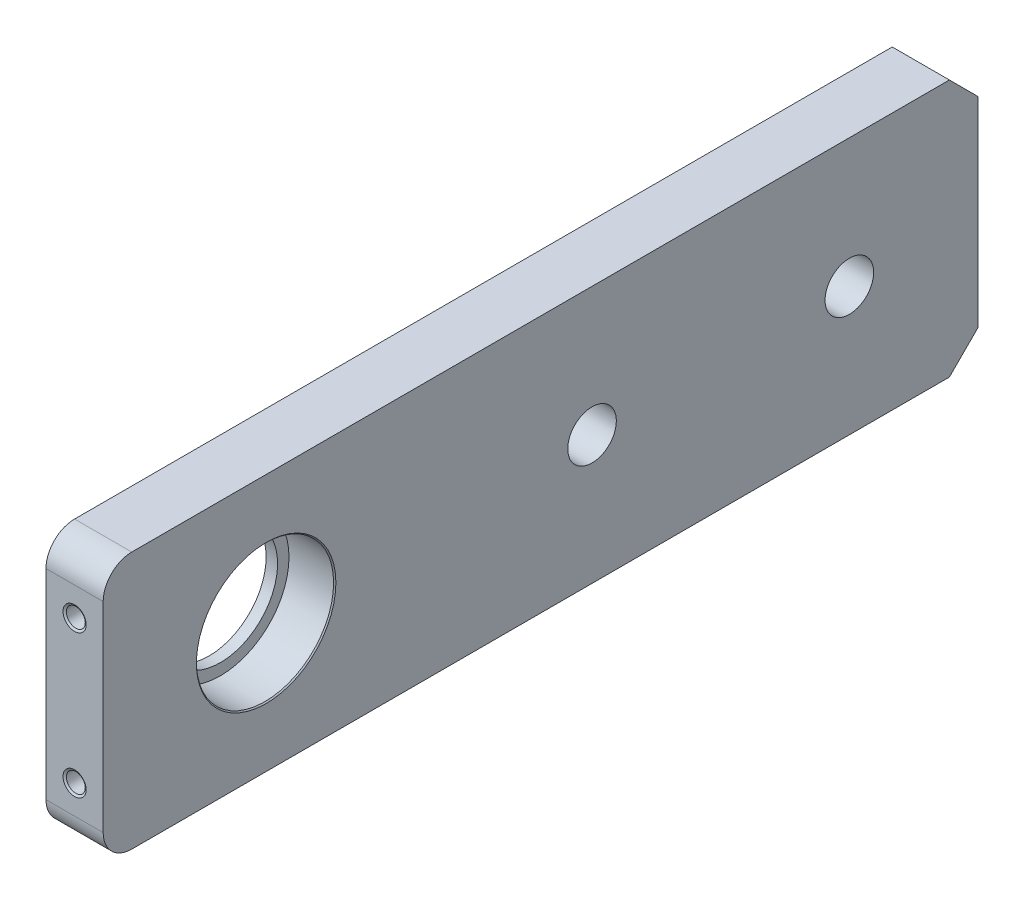
ISO-10303-21;
HEADER;
FILE_DESCRIPTION(('STEP AP214'),'2;1');
FILE_NAME('part.step','',(''),(''),'','','');
FILE_SCHEMA(('AUTOMOTIVE_DESIGN { 1 0 10303 214 1 1 1 1 }'));
ENDSEC;
DATA;
#1=APPLICATION_CONTEXT('core data for automotive mechanical design processes');
#2=APPLICATION_PROTOCOL_DEFINITION('international standard','automotive_design',2000,#1);
#3=PRODUCT_CONTEXT('',#1,'mechanical');
#4=PRODUCT('Part','Part','',(#3));
#5=PRODUCT_RELATED_PRODUCT_CATEGORY('part','',(#4));
#6=PRODUCT_DEFINITION_FORMATION('','',#4);
#7=PRODUCT_DEFINITION_CONTEXT('part definition',#1,'design');
#8=PRODUCT_DEFINITION('design','',#6,#7);
#9=PRODUCT_DEFINITION_SHAPE('','',#8);
#10=(LENGTH_UNIT() NAMED_UNIT(*) SI_UNIT(.MILLI.,.METRE.));
#11=(NAMED_UNIT(*) PLANE_ANGLE_UNIT() SI_UNIT($,.RADIAN.));
#12=(NAMED_UNIT(*) SI_UNIT($,.STERADIAN.) SOLID_ANGLE_UNIT());
#13=UNCERTAINTY_MEASURE_WITH_UNIT(LENGTH_MEASURE(1.E-05),#10,'distance_accuracy_value','');
#14=(GEOMETRIC_REPRESENTATION_CONTEXT(3) GLOBAL_UNCERTAINTY_ASSIGNED_CONTEXT((#13)) GLOBAL_UNIT_ASSIGNED_CONTEXT((#10,
#11,#12)) REPRESENTATION_CONTEXT('',''));
#15=CARTESIAN_POINT('',(0.,0.,0.));
#16=DIRECTION('',(0.,0.,1.));
#17=DIRECTION('',(1.,0.,0.));
#18=AXIS2_PLACEMENT_3D('',#15,#16,#17);
#19=CARTESIAN_POINT('',(5.,0.,0.));
#20=DIRECTION('',(1.,0.,0.));
#21=DIRECTION('',(0.,0.,-1.));
#22=AXIS2_PLACEMENT_3D('',#19,#20,#21);
#23=PLANE('',#22);
#24=CARTESIAN_POINT('',(5.,-22.5,-28.5));
#25=DIRECTION('',(1.,0.,0.));
#26=DIRECTION('',(0.,0.,-1.));
#27=AXIS2_PLACEMENT_3D('',#24,#25,#26);
#28=CIRCLE('',#27,12.2);
#29=CARTESIAN_POINT('',(5.,-22.5,-40.7));
#30=VERTEX_POINT('',#29);
#31=EDGE_CURVE('E45',#30,#30,#28,.F.);
#32=ORIENTED_EDGE('',*,*,#31,.T.);
#33=EDGE_LOOP('',(#32));
#34=FACE_BOUND('',#33,.T.);
#35=CARTESIAN_POINT('',(5.,-22.5,-85.5));
#36=DIRECTION('',(1.,0.,0.));
#37=DIRECTION('',(0.,0.,-1.));
#38=AXIS2_PLACEMENT_3D('',#35,#36,#37);
#39=CIRCLE('',#38,4.25);
#40=CARTESIAN_POINT('',(5.,-22.5,-89.75));
#41=VERTEX_POINT('',#40);
#42=EDGE_CURVE('E241',#41,#41,#39,.T.);
#43=ORIENTED_EDGE('',*,*,#42,.F.);
#44=EDGE_LOOP('',(#43));
#45=FACE_BOUND('',#44,.T.);
#46=DIRECTION('',(0.,0.,1.));
#47=VECTOR('',#46,1.);
#48=CARTESIAN_POINT('',(5.,0.,0.));
#49=LINE('',#48,#47);
#50=CARTESIAN_POINT('',(5.,0.,-148.));
#51=VERTEX_POINT('',#50);
#52=CARTESIAN_POINT('',(5.,0.,-5.));
#53=VERTEX_POINT('',#52);
#54=EDGE_CURVE('E146',#51,#53,#49,.T.);
#55=ORIENTED_EDGE('',*,*,#54,.T.);
#56=CARTESIAN_POINT('',(5.,-5.,-5.));
#57=DIRECTION('',(1.,0.,0.));
#58=DIRECTION('',(0.,0.,-1.));
#59=AXIS2_PLACEMENT_3D('',#56,#57,#58);
#60=CIRCLE('',#59,5.);
#61=CARTESIAN_POINT('',(5.,-5.,0.));
#62=VERTEX_POINT('',#61);
#63=EDGE_CURVE('E168',#53,#62,#60,.T.);
#64=ORIENTED_EDGE('',*,*,#63,.T.);
#65=DIRECTION('',(0.,-1.,0.));
#66=VECTOR('',#65,1.);
#67=CARTESIAN_POINT('',(5.,0.,0.));
#68=LINE('',#67,#66);
#69=CARTESIAN_POINT('',(5.,-40.,0.));
#70=VERTEX_POINT('',#69);
#71=EDGE_CURVE('E135',#62,#70,#68,.T.);
#72=ORIENTED_EDGE('',*,*,#71,.T.);
#73=CARTESIAN_POINT('',(5.,-40.,-5.00000000000001));
#74=DIRECTION('',(1.,0.,0.));
#75=DIRECTION('',(0.,0.,-1.));
#76=AXIS2_PLACEMENT_3D('',#73,#74,#75);
#77=CIRCLE('',#76,5.);
#78=CARTESIAN_POINT('',(5.,-45.,-5.00000000000001));
#79=VERTEX_POINT('',#78);
#80=EDGE_CURVE('E52',#70,#79,#77,.T.);
#81=ORIENTED_EDGE('',*,*,#80,.T.);
#82=DIRECTION('',(0.,0.,-1.));
#83=VECTOR('',#82,1.);
#84=CARTESIAN_POINT('',(5.,-45.,0.));
#85=LINE('',#84,#83);
#86=CARTESIAN_POINT('',(5.,-45.,-148.));
#87=VERTEX_POINT('',#86);
#88=EDGE_CURVE('E232',#79,#87,#85,.T.);
#89=ORIENTED_EDGE('',*,*,#88,.T.);
#90=DIRECTION('',(0.,-0.707106781186547,0.707106781186549));
#91=VECTOR('',#90,1.);
#92=CARTESIAN_POINT('',(5.,-96.5000000000001,-96.4999999999998));
#93=LINE('',#92,#91);
#94=CARTESIAN_POINT('',(5.,-40.,-153.));
#95=VERTEX_POINT('',#94);
#96=EDGE_CURVE('E152',#87,#95,#93,.F.);
#97=ORIENTED_EDGE('',*,*,#96,.T.);
#98=DIRECTION('',(0.,1.,0.));
#99=VECTOR('',#98,1.);
#100=CARTESIAN_POINT('',(5.,0.,-153.));
#101=LINE('',#100,#99);
#102=CARTESIAN_POINT('',(5.,-5.,-153.));
#103=VERTEX_POINT('',#102);
#104=EDGE_CURVE('E125',#95,#103,#101,.T.);
#105=ORIENTED_EDGE('',*,*,#104,.T.);
#106=DIRECTION('',(0.,-0.707106781186551,-0.707106781186544));
#107=VECTOR('',#106,1.);
#108=CARTESIAN_POINT('',(5.,74.,-74.0000000000008));
#109=LINE('',#108,#107);
#110=EDGE_CURVE('E150',#103,#51,#109,.F.);
#111=ORIENTED_EDGE('',*,*,#110,.T.);
#112=EDGE_LOOP('',(#55,#64,#72,#81,#89,#97,#105,#111));
#113=FACE_BOUND('',#112,.T.);
#114=CARTESIAN_POINT('',(5.,-22.5,-130.5));
#115=DIRECTION('',(1.,0.,0.));
#116=DIRECTION('',(0.,0.,-1.));
#117=AXIS2_PLACEMENT_3D('',#114,#115,#116);
#118=CIRCLE('',#117,4.25);
#119=CARTESIAN_POINT('',(5.,-22.5,-134.75));
#120=VERTEX_POINT('',#119);
#121=EDGE_CURVE('E249',#120,#120,#118,.T.);
#122=ORIENTED_EDGE('',*,*,#121,.F.);
#123=EDGE_LOOP('',(#122));
#124=FACE_BOUND('',#123,.T.);
#125=ADVANCED_FACE('F37',(#34,#45,#113,#124),#23,.T.);
#126=CARTESIAN_POINT('',(-5.,0.,0.));
#127=DIRECTION('',(1.,0.,0.));
#128=DIRECTION('',(0.,0.,-1.));
#129=AXIS2_PLACEMENT_3D('',#126,#127,#128);
#130=PLANE('',#129);
#131=DIRECTION('',(0.,-1.,0.));
#132=VECTOR('',#131,1.);
#133=CARTESIAN_POINT('',(-5.,0.,0.));
#134=LINE('',#133,#132);
#135=CARTESIAN_POINT('',(-5.,-5.,0.));
#136=VERTEX_POINT('',#135);
#137=CARTESIAN_POINT('',(-5.,-40.,0.));
#138=VERTEX_POINT('',#137);
#139=EDGE_CURVE('E137',#136,#138,#134,.T.);
#140=ORIENTED_EDGE('',*,*,#139,.F.);
#141=CARTESIAN_POINT('',(-5.,-5.,-5.));
#142=DIRECTION('',(1.,0.,0.));
#143=DIRECTION('',(0.,0.,-1.));
#144=AXIS2_PLACEMENT_3D('',#141,#142,#143);
#145=CIRCLE('',#144,5.);
#146=CARTESIAN_POINT('',(-5.,0.,-5.));
#147=VERTEX_POINT('',#146);
#148=EDGE_CURVE('E164',#136,#147,#145,.F.);
#149=ORIENTED_EDGE('',*,*,#148,.T.);
#150=DIRECTION('',(0.,0.,1.));
#151=VECTOR('',#150,1.);
#152=CARTESIAN_POINT('',(-5.,0.,0.));
#153=LINE('',#152,#151);
#154=CARTESIAN_POINT('',(-5.,0.,-148.));
#155=VERTEX_POINT('',#154);
#156=EDGE_CURVE('E132',#155,#147,#153,.T.);
#157=ORIENTED_EDGE('',*,*,#156,.F.);
#158=DIRECTION('',(0.,0.707106781186551,0.707106781186544));
#159=VECTOR('',#158,1.);
#160=CARTESIAN_POINT('',(-5.,0.,-148.));
#161=LINE('',#160,#159);
#162=CARTESIAN_POINT('',(-5.,-5.,-153.));
#163=VERTEX_POINT('',#162);
#164=EDGE_CURVE('E116',#155,#163,#161,.F.);
#165=ORIENTED_EDGE('',*,*,#164,.T.);
#166=DIRECTION('',(0.,1.,0.));
#167=VECTOR('',#166,1.);
#168=CARTESIAN_POINT('',(-5.,0.,-153.));
#169=LINE('',#168,#167);
#170=CARTESIAN_POINT('',(-5.,-40.,-153.));
#171=VERTEX_POINT('',#170);
#172=EDGE_CURVE('E122',#171,#163,#169,.T.);
#173=ORIENTED_EDGE('',*,*,#172,.F.);
#174=DIRECTION('',(0.,0.707106781186547,-0.707106781186549));
#175=VECTOR('',#174,1.);
#176=CARTESIAN_POINT('',(-5.,-40.,-153.));
#177=LINE('',#176,#175);
#178=CARTESIAN_POINT('',(-5.,-45.,-148.));
#179=VERTEX_POINT('',#178);
#180=EDGE_CURVE('E106',#171,#179,#177,.F.);
#181=ORIENTED_EDGE('',*,*,#180,.T.);
#182=DIRECTION('',(0.,0.,-1.));
#183=VECTOR('',#182,1.);
#184=CARTESIAN_POINT('',(-5.,-45.,0.));
#185=LINE('',#184,#183);
#186=CARTESIAN_POINT('',(-5.,-45.,-5.00000000000001));
#187=VERTEX_POINT('',#186);
#188=EDGE_CURVE('E133',#187,#179,#185,.T.);
#189=ORIENTED_EDGE('',*,*,#188,.F.);
#190=CARTESIAN_POINT('',(-5.,-40.,-5.00000000000001));
#191=DIRECTION('',(1.,0.,0.));
#192=DIRECTION('',(0.,0.,-1.));
#193=AXIS2_PLACEMENT_3D('',#190,#191,#192);
#194=CIRCLE('',#193,5.);
#195=EDGE_CURVE('E162',#187,#138,#194,.F.);
#196=ORIENTED_EDGE('',*,*,#195,.T.);
#197=EDGE_LOOP('',(#140,#149,#157,#165,#173,#181,#189,#196));
#198=FACE_BOUND('',#197,.T.);
#199=CARTESIAN_POINT('',(-5.,-22.5,-28.5));
#200=DIRECTION('',(1.,0.,0.));
#201=DIRECTION('',(0.,0.,-1.));
#202=AXIS2_PLACEMENT_3D('',#199,#200,#201);
#203=CIRCLE('',#202,10.);
#204=CARTESIAN_POINT('',(-5.,-22.5,-38.5));
#205=VERTEX_POINT('',#204);
#206=EDGE_CURVE('E236',#205,#205,#203,.T.);
#207=ORIENTED_EDGE('',*,*,#206,.T.);
#208=EDGE_LOOP('',(#207));
#209=FACE_BOUND('',#208,.T.);
#210=CARTESIAN_POINT('',(-5.,-22.5,-85.5));
#211=DIRECTION('',(1.,0.,0.));
#212=DIRECTION('',(0.,0.,-1.));
#213=AXIS2_PLACEMENT_3D('',#210,#211,#212);
#214=CIRCLE('',#213,4.25);
#215=CARTESIAN_POINT('',(-5.,-22.5,-89.75));
#216=VERTEX_POINT('',#215);
#217=EDGE_CURVE('E244',#216,#216,#214,.T.);
#218=ORIENTED_EDGE('',*,*,#217,.T.);
#219=EDGE_LOOP('',(#218));
#220=FACE_BOUND('',#219,.T.);
#221=CARTESIAN_POINT('',(-5.,-22.5,-130.5));
#222=DIRECTION('',(1.,0.,0.));
#223=DIRECTION('',(0.,0.,-1.));
#224=AXIS2_PLACEMENT_3D('',#221,#222,#223);
#225=CIRCLE('',#224,4.25);
#226=CARTESIAN_POINT('',(-5.,-22.5,-134.75));
#227=VERTEX_POINT('',#226);
#228=EDGE_CURVE('E144',#227,#227,#225,.T.);
#229=ORIENTED_EDGE('',*,*,#228,.T.);
#230=EDGE_LOOP('',(#229));
#231=FACE_BOUND('',#230,.T.);
#232=ADVANCED_FACE('F129',(#198,#209,#220,#231),#130,.F.);
#233=CARTESIAN_POINT('',(5.,0.,0.));
#234=DIRECTION('',(0.,0.,-1.));
#235=DIRECTION('',(0.,1.,0.));
#236=AXIS2_PLACEMENT_3D('',#233,#234,#235);
#237=PLANE('',#236);
#238=CARTESIAN_POINT('',(0.,-9.99999999999999,0.));
#239=DIRECTION('',(0.,0.,1.));
#240=DIRECTION('',(1.,0.,0.));
#241=AXIS2_PLACEMENT_3D('',#238,#239,#240);
#242=CIRCLE('',#241,2.025);
#243=CARTESIAN_POINT('',(2.025,-9.99999999999999,0.));
#244=VERTEX_POINT('',#243);
#245=EDGE_CURVE('E272',#244,#244,#242,.T.);
#246=ORIENTED_EDGE('',*,*,#245,.F.);
#247=EDGE_LOOP('',(#246));
#248=FACE_BOUND('',#247,.T.);
#249=CARTESIAN_POINT('',(0.,-35.,0.));
#250=DIRECTION('',(0.,0.,1.));
#251=DIRECTION('',(1.,0.,0.));
#252=AXIS2_PLACEMENT_3D('',#249,#250,#251);
#253=CIRCLE('',#252,2.025);
#254=CARTESIAN_POINT('',(2.025,-35.,0.));
#255=VERTEX_POINT('',#254);
#256=EDGE_CURVE('E263',#255,#255,#253,.T.);
#257=ORIENTED_EDGE('',*,*,#256,.F.);
#258=EDGE_LOOP('',(#257));
#259=FACE_BOUND('',#258,.T.);
#260=ORIENTED_EDGE('',*,*,#71,.F.);
#261=DIRECTION('',(-1.,0.,0.));
#262=VECTOR('',#261,1.);
#263=CARTESIAN_POINT('',(5.,-5.,0.));
#264=LINE('',#263,#262);
#265=EDGE_CURVE('E159',#62,#136,#264,.T.);
#266=ORIENTED_EDGE('',*,*,#265,.T.);
#267=ORIENTED_EDGE('',*,*,#139,.T.);
#268=DIRECTION('',(-1.,0.,0.));
#269=VECTOR('',#268,1.);
#270=CARTESIAN_POINT('',(5.,-40.,0.));
#271=LINE('',#270,#269);
#272=EDGE_CURVE('E157',#138,#70,#271,.F.);
#273=ORIENTED_EDGE('',*,*,#272,.T.);
#274=EDGE_LOOP('',(#260,#266,#267,#273));
#275=FACE_BOUND('',#274,.T.);
#276=ADVANCED_FACE('F196',(#248,#259,#275),#237,.F.);
#277=CARTESIAN_POINT('',(5.,-45.,0.));
#278=DIRECTION('',(0.,1.,0.));
#279=DIRECTION('',(0.,0.,1.));
#280=AXIS2_PLACEMENT_3D('',#277,#278,#279);
#281=PLANE('',#280);
#282=ORIENTED_EDGE('',*,*,#88,.F.);
#283=DIRECTION('',(-1.,0.,0.));
#284=VECTOR('',#283,1.);
#285=CARTESIAN_POINT('',(5.,-45.,-5.00000000000001));
#286=LINE('',#285,#284);
#287=EDGE_CURVE('E170',#79,#187,#286,.T.);
#288=ORIENTED_EDGE('',*,*,#287,.T.);
#289=ORIENTED_EDGE('',*,*,#188,.T.);
#290=DIRECTION('',(1.,0.,0.));
#291=VECTOR('',#290,1.);
#292=CARTESIAN_POINT('',(5.,-45.,-148.));
#293=LINE('',#292,#291);
#294=EDGE_CURVE('E112',#179,#87,#293,.T.);
#295=ORIENTED_EDGE('',*,*,#294,.T.);
#296=EDGE_LOOP('',(#282,#288,#289,#295));
#297=FACE_BOUND('',#296,.T.);
#298=ADVANCED_FACE('F207',(#297),#281,.F.);
#299=CARTESIAN_POINT('',(5.,0.,-153.));
#300=DIRECTION('',(0.,0.,1.));
#301=DIRECTION('',(1.,0.,0.));
#302=AXIS2_PLACEMENT_3D('',#299,#300,#301);
#303=PLANE('',#302);
#304=ORIENTED_EDGE('',*,*,#104,.F.);
#305=DIRECTION('',(-1.,0.,0.));
#306=VECTOR('',#305,1.);
#307=CARTESIAN_POINT('',(5.,-40.,-153.));
#308=LINE('',#307,#306);
#309=EDGE_CURVE('E110',#95,#171,#308,.T.);
#310=ORIENTED_EDGE('',*,*,#309,.T.);
#311=ORIENTED_EDGE('',*,*,#172,.T.);
#312=DIRECTION('',(1.,0.,0.));
#313=VECTOR('',#312,1.);
#314=CARTESIAN_POINT('',(5.,-5.,-153.));
#315=LINE('',#314,#313);
#316=EDGE_CURVE('E126',#163,#103,#315,.T.);
#317=ORIENTED_EDGE('',*,*,#316,.T.);
#318=EDGE_LOOP('',(#304,#310,#311,#317));
#319=FACE_BOUND('',#318,.T.);
#320=ADVANCED_FACE('F121',(#319),#303,.F.);
#321=CARTESIAN_POINT('',(5.,0.,0.));
#322=DIRECTION('',(0.,-1.,0.));
#323=DIRECTION('',(0.,0.,-1.));
#324=AXIS2_PLACEMENT_3D('',#321,#322,#323);
#325=PLANE('',#324);
#326=ORIENTED_EDGE('',*,*,#156,.T.);
#327=DIRECTION('',(-1.,0.,0.));
#328=VECTOR('',#327,1.);
#329=CARTESIAN_POINT('',(5.,0.,-5.));
#330=LINE('',#329,#328);
#331=EDGE_CURVE('E60',#147,#53,#330,.F.);
#332=ORIENTED_EDGE('',*,*,#331,.T.);
#333=ORIENTED_EDGE('',*,*,#54,.F.);
#334=DIRECTION('',(-1.,0.,0.));
#335=VECTOR('',#334,1.);
#336=CARTESIAN_POINT('',(5.,0.,-148.));
#337=LINE('',#336,#335);
#338=EDGE_CURVE('E154',#51,#155,#337,.T.);
#339=ORIENTED_EDGE('',*,*,#338,.T.);
#340=EDGE_LOOP('',(#326,#332,#333,#339));
#341=FACE_BOUND('',#340,.T.);
#342=ADVANCED_FACE('F202',(#341),#325,.F.);
#343=CARTESIAN_POINT('',(5.,-22.5,-28.5));
#344=DIRECTION('',(-1.,0.,0.));
#345=DIRECTION('',(0.,0.,1.));
#346=AXIS2_PLACEMENT_3D('',#343,#344,#345);
#347=CYLINDRICAL_SURFACE('',#346,10.);
#348=CARTESIAN_POINT('',(-3.,-22.5,-28.5));
#349=DIRECTION('',(-1.,0.,0.));
#350=DIRECTION('',(0.,0.,1.));
#351=AXIS2_PLACEMENT_3D('',#348,#349,#350);
#352=CIRCLE('',#351,10.);
#353=CARTESIAN_POINT('',(-3.,-22.5,-18.5));
#354=VERTEX_POINT('',#353);
#355=EDGE_CURVE('E141',#354,#354,#352,.T.);
#356=ORIENTED_EDGE('',*,*,#355,.F.);
#357=EDGE_LOOP('',(#356));
#358=FACE_BOUND('',#357,.T.);
#359=ORIENTED_EDGE('',*,*,#206,.F.);
#360=EDGE_LOOP('',(#359));
#361=FACE_BOUND('',#360,.T.);
#362=ADVANCED_FACE('F199',(#358,#361),#347,.F.);
#363=CARTESIAN_POINT('',(5.,-22.5,-85.5));
#364=DIRECTION('',(-1.,0.,0.));
#365=DIRECTION('',(0.,0.,1.));
#366=AXIS2_PLACEMENT_3D('',#363,#364,#365);
#367=CYLINDRICAL_SURFACE('',#366,4.25);
#368=ORIENTED_EDGE('',*,*,#42,.T.);
#369=EDGE_LOOP('',(#368));
#370=FACE_BOUND('',#369,.T.);
#371=ORIENTED_EDGE('',*,*,#217,.F.);
#372=EDGE_LOOP('',(#371));
#373=FACE_BOUND('',#372,.T.);
#374=ADVANCED_FACE('F306',(#370,#373),#367,.F.);
#375=CARTESIAN_POINT('',(5.,-22.5,-130.5));
#376=DIRECTION('',(-1.,0.,0.));
#377=DIRECTION('',(0.,0.,1.));
#378=AXIS2_PLACEMENT_3D('',#375,#376,#377);
#379=CYLINDRICAL_SURFACE('',#378,4.25);
#380=ORIENTED_EDGE('',*,*,#121,.T.);
#381=EDGE_LOOP('',(#380));
#382=FACE_BOUND('',#381,.T.);
#383=ORIENTED_EDGE('',*,*,#228,.F.);
#384=EDGE_LOOP('',(#383));
#385=FACE_BOUND('',#384,.T.);
#386=ADVANCED_FACE('F303',(#382,#385),#379,.F.);
#387=CARTESIAN_POINT('',(-3.,-22.5,-28.5));
#388=DIRECTION('',(1.,0.,0.));
#389=DIRECTION('',(0.,0.,-1.));
#390=AXIS2_PLACEMENT_3D('',#387,#388,#389);
#391=CYLINDRICAL_SURFACE('',#390,12.);
#392=CARTESIAN_POINT('',(4.80000000000001,-22.5,-28.5));
#393=DIRECTION('',(1.,0.,0.));
#394=DIRECTION('',(0.,0.,-1.));
#395=AXIS2_PLACEMENT_3D('',#392,#393,#394);
#396=CIRCLE('',#395,12.);
#397=CARTESIAN_POINT('',(4.80000000000001,-22.5,-40.5));
#398=VERTEX_POINT('',#397);
#399=EDGE_CURVE('E11',#398,#398,#396,.T.);
#400=ORIENTED_EDGE('',*,*,#399,.T.);
#401=EDGE_LOOP('',(#400));
#402=FACE_BOUND('',#401,.T.);
#403=CARTESIAN_POINT('',(-3.,-22.5,-28.5));
#404=DIRECTION('',(-1.,0.,0.));
#405=DIRECTION('',(0.,0.,1.));
#406=AXIS2_PLACEMENT_3D('',#403,#404,#405);
#407=CIRCLE('',#406,12.);
#408=CARTESIAN_POINT('',(-3.,-22.5,-16.5));
#409=VERTEX_POINT('',#408);
#410=EDGE_CURVE('E145',#409,#409,#407,.T.);
#411=ORIENTED_EDGE('',*,*,#410,.T.);
#412=EDGE_LOOP('',(#411));
#413=FACE_BOUND('',#412,.T.);
#414=ADVANCED_FACE('F299',(#402,#413),#391,.F.);
#415=CARTESIAN_POINT('',(-3.,-22.5,-28.5));
#416=DIRECTION('',(-1.,0.,0.));
#417=DIRECTION('',(0.,0.,1.));
#418=AXIS2_PLACEMENT_3D('',#415,#416,#417);
#419=PLANE('',#418);
#420=ORIENTED_EDGE('',*,*,#355,.T.);
#421=EDGE_LOOP('',(#420));
#422=FACE_BOUND('',#421,.T.);
#423=ORIENTED_EDGE('',*,*,#410,.F.);
#424=EDGE_LOOP('',(#423));
#425=FACE_BOUND('',#424,.T.);
#426=ADVANCED_FACE('F217',(#422,#425),#419,.F.);
#427=CARTESIAN_POINT('',(5.,-40.,-153.));
#428=DIRECTION('',(0.,0.707106781186548,0.707106781186546));
#429=DIRECTION('',(-1.,0.,0.));
#430=AXIS2_PLACEMENT_3D('',#427,#428,#429);
#431=PLANE('',#430);
#432=ORIENTED_EDGE('',*,*,#96,.F.);
#433=ORIENTED_EDGE('',*,*,#294,.F.);
#434=ORIENTED_EDGE('',*,*,#180,.F.);
#435=ORIENTED_EDGE('',*,*,#309,.F.);
#436=EDGE_LOOP('',(#432,#433,#434,#435));
#437=FACE_BOUND('',#436,.T.);
#438=ADVANCED_FACE('F109',(#437),#431,.F.);
#439=CARTESIAN_POINT('',(5.,0.,-148.));
#440=DIRECTION('',(0.,-0.707106781186544,0.707106781186551));
#441=DIRECTION('',(-1.,0.,0.));
#442=AXIS2_PLACEMENT_3D('',#439,#440,#441);
#443=PLANE('',#442);
#444=ORIENTED_EDGE('',*,*,#110,.F.);
#445=ORIENTED_EDGE('',*,*,#316,.F.);
#446=ORIENTED_EDGE('',*,*,#164,.F.);
#447=ORIENTED_EDGE('',*,*,#338,.F.);
#448=EDGE_LOOP('',(#444,#445,#446,#447));
#449=FACE_BOUND('',#448,.T.);
#450=ADVANCED_FACE('F216',(#449),#443,.F.);
#451=CARTESIAN_POINT('',(5.,-5.,-5.));
#452=DIRECTION('',(-1.,0.,0.));
#453=DIRECTION('',(0.,0.,1.));
#454=AXIS2_PLACEMENT_3D('',#451,#452,#453);
#455=CYLINDRICAL_SURFACE('',#454,5.);
#456=ORIENTED_EDGE('',*,*,#63,.F.);
#457=ORIENTED_EDGE('',*,*,#331,.F.);
#458=ORIENTED_EDGE('',*,*,#148,.F.);
#459=ORIENTED_EDGE('',*,*,#265,.F.);
#460=EDGE_LOOP('',(#456,#457,#458,#459));
#461=FACE_BOUND('',#460,.T.);
#462=ADVANCED_FACE('F188',(#461),#455,.T.);
#463=CARTESIAN_POINT('',(5.,-40.,-5.00000000000001));
#464=DIRECTION('',(-1.,0.,0.));
#465=DIRECTION('',(0.,0.,1.));
#466=AXIS2_PLACEMENT_3D('',#463,#464,#465);
#467=CYLINDRICAL_SURFACE('',#466,5.);
#468=ORIENTED_EDGE('',*,*,#80,.F.);
#469=ORIENTED_EDGE('',*,*,#272,.F.);
#470=ORIENTED_EDGE('',*,*,#195,.F.);
#471=ORIENTED_EDGE('',*,*,#287,.F.);
#472=EDGE_LOOP('',(#468,#469,#470,#471));
#473=FACE_BOUND('',#472,.T.);
#474=ADVANCED_FACE('F179',(#473),#467,.T.);
#475=CARTESIAN_POINT('',(5.,-22.5,-28.5));
#476=DIRECTION('',(1.,0.,0.));
#477=DIRECTION('',(0.,0.,-1.));
#478=AXIS2_PLACEMENT_3D('',#475,#476,#477);
#479=CONICAL_SURFACE('',#478,12.2,0.78539816339747);
#480=ORIENTED_EDGE('',*,*,#399,.F.);
#481=EDGE_LOOP('',(#480));
#482=FACE_BOUND('',#481,.T.);
#483=ORIENTED_EDGE('',*,*,#31,.F.);
#484=EDGE_LOOP('',(#483));
#485=FACE_BOUND('',#484,.T.);
#486=ADVANCED_FACE('F39',(#482,#485),#479,.F.);
#487=CARTESIAN_POINT('',(0.,-35.,-15.5));
#488=DIRECTION('',(0.,0.,-1.));
#489=DIRECTION('',(-1.,0.,0.));
#490=AXIS2_PLACEMENT_3D('',#487,#488,#489);
#491=PLANE('',#490);
#492=CARTESIAN_POINT('',(0.,-35.,-15.5));
#493=DIRECTION('',(0.,0.,1.));
#494=DIRECTION('',(1.,0.,0.));
#495=AXIS2_PLACEMENT_3D('',#492,#493,#494);
#496=CIRCLE('',#495,1.64999999999999);
#497=CARTESIAN_POINT('',(1.64999999999999,-35.,-15.5));
#498=VERTEX_POINT('',#497);
#499=EDGE_CURVE('E257',#498,#498,#496,.T.);
#500=ORIENTED_EDGE('',*,*,#499,.T.);
#501=EDGE_LOOP('',(#500));
#502=FACE_BOUND('',#501,.T.);
#503=ADVANCED_FACE('F178',(#502),#491,.F.);
#504=CARTESIAN_POINT('',(0.,-35.,0.));
#505=DIRECTION('',(0.,0.,1.));
#506=DIRECTION('',(1.,0.,0.));
#507=AXIS2_PLACEMENT_3D('',#504,#505,#506);
#508=CYLINDRICAL_SURFACE('',#507,1.64999999999999);
#509=ORIENTED_EDGE('',*,*,#499,.F.);
#510=EDGE_LOOP('',(#509));
#511=FACE_BOUND('',#510,.T.);
#512=CARTESIAN_POINT('',(0.,-35.,-0.216506350946111));
#513=DIRECTION('',(0.,0.,1.));
#514=DIRECTION('',(1.,0.,0.));
#515=AXIS2_PLACEMENT_3D('',#512,#513,#514);
#516=CIRCLE('',#515,1.64999999999999);
#517=CARTESIAN_POINT('',(1.64999999999999,-35.,-0.216506350946111));
#518=VERTEX_POINT('',#517);
#519=EDGE_CURVE('E260',#518,#518,#516,.T.);
#520=ORIENTED_EDGE('',*,*,#519,.T.);
#521=EDGE_LOOP('',(#520));
#522=FACE_BOUND('',#521,.T.);
#523=ADVANCED_FACE('F185',(#511,#522),#508,.F.);
#524=CARTESIAN_POINT('',(0.,-35.,0.));
#525=DIRECTION('',(0.,0.,1.));
#526=DIRECTION('',(1.,0.,0.));
#527=AXIS2_PLACEMENT_3D('',#524,#525,#526);
#528=CONICAL_SURFACE('',#527,2.025,1.0471975511966);
#529=ORIENTED_EDGE('',*,*,#519,.F.);
#530=EDGE_LOOP('',(#529));
#531=FACE_BOUND('',#530,.T.);
#532=ORIENTED_EDGE('',*,*,#256,.T.);
#533=EDGE_LOOP('',(#532));
#534=FACE_BOUND('',#533,.T.);
#535=ADVANCED_FACE('F280',(#531,#534),#528,.F.);
#536=CARTESIAN_POINT('',(0.,-9.99999999999999,-15.5));
#537=DIRECTION('',(0.,0.,-1.));
#538=DIRECTION('',(-1.,0.,0.));
#539=AXIS2_PLACEMENT_3D('',#536,#537,#538);
#540=PLANE('',#539);
#541=CARTESIAN_POINT('',(0.,-9.99999999999999,-15.5));
#542=DIRECTION('',(0.,0.,1.));
#543=DIRECTION('',(1.,0.,0.));
#544=AXIS2_PLACEMENT_3D('',#541,#542,#543);
#545=CIRCLE('',#544,1.64999999999999);
#546=CARTESIAN_POINT('',(1.64999999999999,-9.99999999999999,-15.5));
#547=VERTEX_POINT('',#546);
#548=EDGE_CURVE('E266',#547,#547,#545,.T.);
#549=ORIENTED_EDGE('',*,*,#548,.T.);
#550=EDGE_LOOP('',(#549));
#551=FACE_BOUND('',#550,.T.);
#552=ADVANCED_FACE('F282',(#551),#540,.F.);
#553=CARTESIAN_POINT('',(0.,-9.99999999999999,0.));
#554=DIRECTION('',(0.,0.,1.));
#555=DIRECTION('',(1.,0.,0.));
#556=AXIS2_PLACEMENT_3D('',#553,#554,#555);
#557=CYLINDRICAL_SURFACE('',#556,1.64999999999999);
#558=ORIENTED_EDGE('',*,*,#548,.F.);
#559=EDGE_LOOP('',(#558));
#560=FACE_BOUND('',#559,.T.);
#561=CARTESIAN_POINT('',(0.,-9.99999999999999,-0.216506350946111));
#562=DIRECTION('',(0.,0.,1.));
#563=DIRECTION('',(1.,0.,0.));
#564=AXIS2_PLACEMENT_3D('',#561,#562,#563);
#565=CIRCLE('',#564,1.64999999999999);
#566=CARTESIAN_POINT('',(1.64999999999999,-9.99999999999999,-0.216506350946111));
#567=VERTEX_POINT('',#566);
#568=EDGE_CURVE('E269',#567,#567,#565,.T.);
#569=ORIENTED_EDGE('',*,*,#568,.T.);
#570=EDGE_LOOP('',(#569));
#571=FACE_BOUND('',#570,.T.);
#572=ADVANCED_FACE('F289',(#560,#571),#557,.F.);
#573=CARTESIAN_POINT('',(0.,-9.99999999999999,0.));
#574=DIRECTION('',(0.,0.,1.));
#575=DIRECTION('',(1.,0.,0.));
#576=AXIS2_PLACEMENT_3D('',#573,#574,#575);
#577=CONICAL_SURFACE('',#576,2.025,1.0471975511966);
#578=ORIENTED_EDGE('',*,*,#568,.F.);
#579=EDGE_LOOP('',(#578));
#580=FACE_BOUND('',#579,.T.);
#581=ORIENTED_EDGE('',*,*,#245,.T.);
#582=EDGE_LOOP('',(#581));
#583=FACE_BOUND('',#582,.T.);
#584=ADVANCED_FACE('F276',(#580,#583),#577,.F.);
#585=CLOSED_SHELL('',(#125,#232,#276,#298,#320,#342,#362,#374,#386,#414,#426,#438,#450,#462,
#474,#486,#503,#523,#535,#552,#572,#584));
#586=MANIFOLD_SOLID_BREP('B2',#585);
#587=ADVANCED_BREP_SHAPE_REPRESENTATION('',(#18,#586),#14);
#588=SHAPE_DEFINITION_REPRESENTATION(#9,#587);
ENDSEC;
END-ISO-10303-21;
